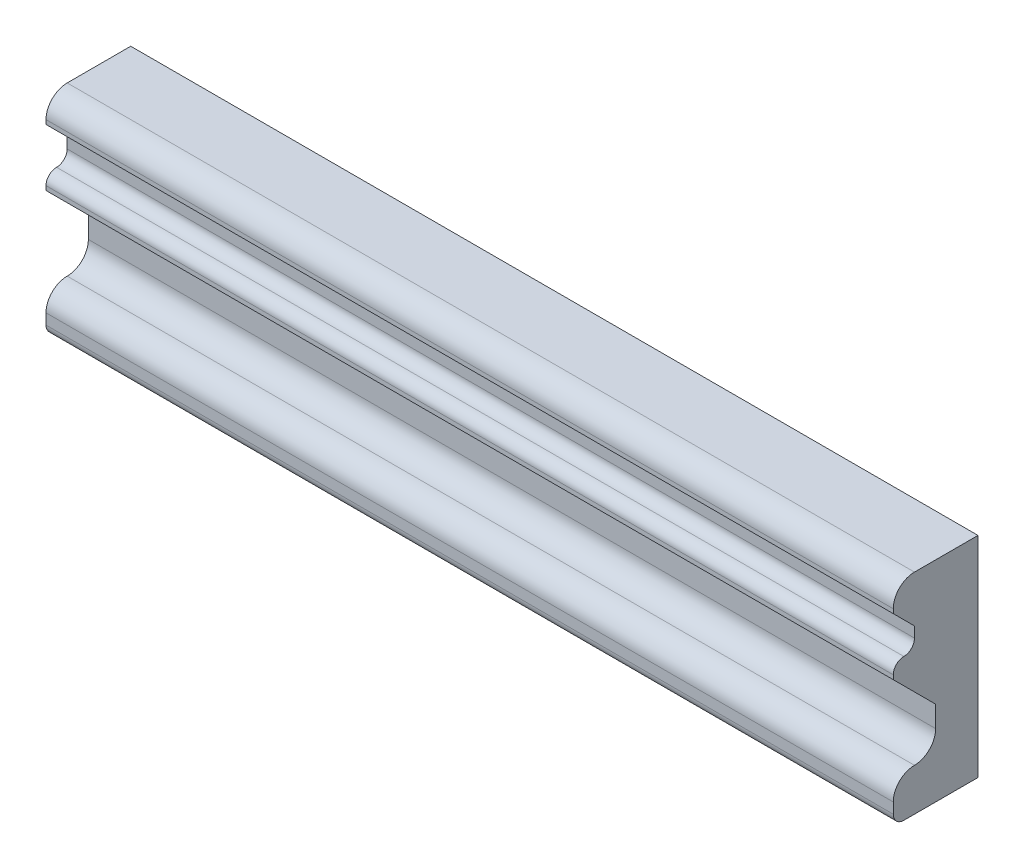
ISO-10303-21;
HEADER;
FILE_DESCRIPTION(('STEP AP214'),'2;1');
FILE_NAME('part.step','',(''),(''),'','','');
FILE_SCHEMA(('AUTOMOTIVE_DESIGN { 1 0 10303 214 1 1 1 1 }'));
ENDSEC;
DATA;
#1=APPLICATION_CONTEXT('core data for automotive mechanical design processes');
#2=APPLICATION_PROTOCOL_DEFINITION('international standard','automotive_design',2000,#1);
#3=PRODUCT_CONTEXT('',#1,'mechanical');
#4=PRODUCT('Part','Part','',(#3));
#5=PRODUCT_RELATED_PRODUCT_CATEGORY('part','',(#4));
#6=PRODUCT_DEFINITION_FORMATION('','',#4);
#7=PRODUCT_DEFINITION_CONTEXT('part definition',#1,'design');
#8=PRODUCT_DEFINITION('design','',#6,#7);
#9=PRODUCT_DEFINITION_SHAPE('','',#8);
#10=(LENGTH_UNIT() NAMED_UNIT(*) SI_UNIT(.MILLI.,.METRE.));
#11=(NAMED_UNIT(*) PLANE_ANGLE_UNIT() SI_UNIT($,.RADIAN.));
#12=(NAMED_UNIT(*) SI_UNIT($,.STERADIAN.) SOLID_ANGLE_UNIT());
#13=UNCERTAINTY_MEASURE_WITH_UNIT(LENGTH_MEASURE(1.E-05),#10,'distance_accuracy_value','');
#14=(GEOMETRIC_REPRESENTATION_CONTEXT(3) GLOBAL_UNCERTAINTY_ASSIGNED_CONTEXT((#13)) GLOBAL_UNIT_ASSIGNED_CONTEXT((#10,
#11,#12)) REPRESENTATION_CONTEXT('',''));
#15=CARTESIAN_POINT('',(0.,0.,0.));
#16=DIRECTION('',(0.,0.,1.));
#17=DIRECTION('',(1.,0.,0.));
#18=AXIS2_PLACEMENT_3D('',#15,#16,#17);
#19=CARTESIAN_POINT('',(400.,-49.5000000000001,-20.));
#20=DIRECTION('',(0.,0.,1.));
#21=DIRECTION('',(1.,0.,0.));
#22=AXIS2_PLACEMENT_3D('',#19,#20,#21);
#23=PLANE('',#22);
#24=DIRECTION('',(0.,1.,0.));
#25=VECTOR('',#24,1.);
#26=CARTESIAN_POINT('',(0.,-49.5000000000001,-20.));
#27=LINE('',#26,#25);
#28=CARTESIAN_POINT('',(0.,-49.5000000000001,-20.));
#29=VERTEX_POINT('',#28);
#30=CARTESIAN_POINT('',(0.,49.5000000000001,-20.));
#31=VERTEX_POINT('',#30);
#32=EDGE_CURVE('E176',#29,#31,#27,.T.);
#33=ORIENTED_EDGE('',*,*,#32,.T.);
#34=DIRECTION('',(-1.,0.,0.));
#35=VECTOR('',#34,1.);
#36=CARTESIAN_POINT('',(400.,49.5000000000001,-20.));
#37=LINE('',#36,#35);
#38=CARTESIAN_POINT('',(400.,49.5000000000001,-20.));
#39=VERTEX_POINT('',#38);
#40=EDGE_CURVE('E11',#39,#31,#37,.T.);
#41=ORIENTED_EDGE('',*,*,#40,.F.);
#42=DIRECTION('',(0.,1.,0.));
#43=VECTOR('',#42,1.);
#44=CARTESIAN_POINT('',(400.,-49.5000000000001,-20.));
#45=LINE('',#44,#43);
#46=CARTESIAN_POINT('',(400.,-49.5000000000001,-20.));
#47=VERTEX_POINT('',#46);
#48=EDGE_CURVE('E206',#47,#39,#45,.T.);
#49=ORIENTED_EDGE('',*,*,#48,.F.);
#50=DIRECTION('',(-1.,0.,0.));
#51=VECTOR('',#50,1.);
#52=CARTESIAN_POINT('',(400.,-49.5000000000001,-20.));
#53=LINE('',#52,#51);
#54=EDGE_CURVE('E172',#47,#29,#53,.T.);
#55=ORIENTED_EDGE('',*,*,#54,.T.);
#56=EDGE_LOOP('',(#33,#41,#49,#55));
#57=FACE_BOUND('',#56,.T.);
#58=ADVANCED_FACE('F32',(#57),#23,.F.);
#59=CARTESIAN_POINT('',(400.,49.5000000000001,-20.));
#60=DIRECTION('',(0.,-1.,0.));
#61=DIRECTION('',(0.,0.,-1.));
#62=AXIS2_PLACEMENT_3D('',#59,#60,#61);
#63=PLANE('',#62);
#64=DIRECTION('',(0.,0.,1.));
#65=VECTOR('',#64,1.);
#66=CARTESIAN_POINT('',(0.,49.5000000000001,-20.));
#67=LINE('',#66,#65);
#68=CARTESIAN_POINT('',(0.,49.5000000000001,10.));
#69=VERTEX_POINT('',#68);
#70=EDGE_CURVE('E179',#31,#69,#67,.T.);
#71=ORIENTED_EDGE('',*,*,#70,.T.);
#72=DIRECTION('',(-1.,0.,0.));
#73=VECTOR('',#72,1.);
#74=CARTESIAN_POINT('',(400.,49.5000000000001,10.));
#75=LINE('',#74,#73);
#76=CARTESIAN_POINT('',(400.,49.5000000000001,10.));
#77=VERTEX_POINT('',#76);
#78=EDGE_CURVE('E40',#77,#69,#75,.T.);
#79=ORIENTED_EDGE('',*,*,#78,.F.);
#80=DIRECTION('',(0.,0.,1.));
#81=VECTOR('',#80,1.);
#82=CARTESIAN_POINT('',(400.,49.5000000000001,-20.));
#83=LINE('',#82,#81);
#84=EDGE_CURVE('E115',#39,#77,#83,.T.);
#85=ORIENTED_EDGE('',*,*,#84,.F.);
#86=ORIENTED_EDGE('',*,*,#40,.T.);
#87=EDGE_LOOP('',(#71,#79,#85,#86));
#88=FACE_BOUND('',#87,.T.);
#89=ADVANCED_FACE('F304',(#88),#63,.F.);
#90=CARTESIAN_POINT('',(400.,39.5000000000001,10.));
#91=DIRECTION('',(-1.,0.,0.));
#92=DIRECTION('',(0.,0.,1.));
#93=AXIS2_PLACEMENT_3D('',#90,#91,#92);
#94=CYLINDRICAL_SURFACE('',#93,9.99999999999999);
#95=CARTESIAN_POINT('',(0.,39.5000000000001,10.));
#96=DIRECTION('',(1.,0.,0.));
#97=DIRECTION('',(0.,0.,-1.));
#98=AXIS2_PLACEMENT_3D('',#95,#96,#97);
#99=CIRCLE('',#98,9.99999999999999);
#100=CARTESIAN_POINT('',(0.,39.5000000000001,20.));
#101=VERTEX_POINT('',#100);
#102=EDGE_CURVE('E181',#69,#101,#99,.T.);
#103=ORIENTED_EDGE('',*,*,#102,.T.);
#104=DIRECTION('',(-1.,0.,0.));
#105=VECTOR('',#104,1.);
#106=CARTESIAN_POINT('',(400.,39.5000000000001,20.));
#107=LINE('',#106,#105);
#108=CARTESIAN_POINT('',(400.,39.5000000000001,20.));
#109=VERTEX_POINT('',#108);
#110=EDGE_CURVE('E237',#109,#101,#107,.T.);
#111=ORIENTED_EDGE('',*,*,#110,.F.);
#112=CARTESIAN_POINT('',(400.,39.5000000000001,10.));
#113=DIRECTION('',(1.,0.,0.));
#114=DIRECTION('',(0.,0.,-1.));
#115=AXIS2_PLACEMENT_3D('',#112,#113,#114);
#116=CIRCLE('',#115,9.99999999999999);
#117=EDGE_CURVE('E245',#77,#109,#116,.T.);
#118=ORIENTED_EDGE('',*,*,#117,.F.);
#119=ORIENTED_EDGE('',*,*,#78,.T.);
#120=EDGE_LOOP('',(#103,#111,#118,#119));
#121=FACE_BOUND('',#120,.T.);
#122=ADVANCED_FACE('F243',(#121),#94,.T.);
#123=CARTESIAN_POINT('',(400.,37.5000000000001,20.));
#124=DIRECTION('',(0.,0.,-1.));
#125=DIRECTION('',(0.,1.,0.));
#126=AXIS2_PLACEMENT_3D('',#123,#124,#125);
#127=PLANE('',#126);
#128=DIRECTION('',(0.,-1.,0.));
#129=VECTOR('',#128,1.);
#130=CARTESIAN_POINT('',(0.,37.5000000000001,20.));
#131=LINE('',#130,#129);
#132=CARTESIAN_POINT('',(0.,37.5000000000001,20.));
#133=VERTEX_POINT('',#132);
#134=EDGE_CURVE('E183',#101,#133,#131,.T.);
#135=ORIENTED_EDGE('',*,*,#134,.T.);
#136=DIRECTION('',(-1.,0.,0.));
#137=VECTOR('',#136,1.);
#138=CARTESIAN_POINT('',(400.,37.5000000000001,20.));
#139=LINE('',#138,#137);
#140=CARTESIAN_POINT('',(400.,37.5000000000001,20.));
#141=VERTEX_POINT('',#140);
#142=EDGE_CURVE('E234',#141,#133,#139,.T.);
#143=ORIENTED_EDGE('',*,*,#142,.F.);
#144=DIRECTION('',(0.,-1.,0.));
#145=VECTOR('',#144,1.);
#146=CARTESIAN_POINT('',(400.,37.5000000000001,20.));
#147=LINE('',#146,#145);
#148=EDGE_CURVE('E263',#109,#141,#147,.T.);
#149=ORIENTED_EDGE('',*,*,#148,.F.);
#150=ORIENTED_EDGE('',*,*,#110,.T.);
#151=EDGE_LOOP('',(#135,#143,#149,#150));
#152=FACE_BOUND('',#151,.T.);
#153=ADVANCED_FACE('F254',(#152),#127,.F.);
#154=CARTESIAN_POINT('',(400.,37.5000000000001,20.));
#155=DIRECTION('',(0.,0.707106781186544,-0.707106781186551));
#156=DIRECTION('',(0.,0.707106781186551,0.707106781186544));
#157=AXIS2_PLACEMENT_3D('',#154,#155,#156);
#158=PLANE('',#157);
#159=DIRECTION('',(0.,-0.707106781186551,-0.707106781186544));
#160=VECTOR('',#159,1.);
#161=CARTESIAN_POINT('',(0.,37.5000000000001,20.));
#162=LINE('',#161,#160);
#163=CARTESIAN_POINT('',(0.,27.5,10.));
#164=VERTEX_POINT('',#163);
#165=EDGE_CURVE('E185',#133,#164,#162,.T.);
#166=ORIENTED_EDGE('',*,*,#165,.T.);
#167=DIRECTION('',(-1.,0.,0.));
#168=VECTOR('',#167,1.);
#169=CARTESIAN_POINT('',(400.,27.5,10.));
#170=LINE('',#169,#168);
#171=CARTESIAN_POINT('',(400.,27.5,10.));
#172=VERTEX_POINT('',#171);
#173=EDGE_CURVE('E231',#172,#164,#170,.T.);
#174=ORIENTED_EDGE('',*,*,#173,.F.);
#175=DIRECTION('',(0.,-0.707106781186551,-0.707106781186544));
#176=VECTOR('',#175,1.);
#177=CARTESIAN_POINT('',(400.,37.5000000000001,20.));
#178=LINE('',#177,#176);
#179=EDGE_CURVE('E260',#141,#172,#178,.T.);
#180=ORIENTED_EDGE('',*,*,#179,.F.);
#181=ORIENTED_EDGE('',*,*,#142,.T.);
#182=EDGE_LOOP('',(#166,#174,#180,#181));
#183=FACE_BOUND('',#182,.T.);
#184=ADVANCED_FACE('F258',(#183),#158,.F.);
#185=CARTESIAN_POINT('',(400.,27.5,10.));
#186=DIRECTION('',(0.,0.,-1.));
#187=DIRECTION('',(0.,1.,0.));
#188=AXIS2_PLACEMENT_3D('',#185,#186,#187);
#189=PLANE('',#188);
#190=DIRECTION('',(0.,-1.,0.));
#191=VECTOR('',#190,1.);
#192=CARTESIAN_POINT('',(0.,27.5,10.));
#193=LINE('',#192,#191);
#194=CARTESIAN_POINT('',(0.,22.5000000000001,10.));
#195=VERTEX_POINT('',#194);
#196=EDGE_CURVE('E187',#164,#195,#193,.T.);
#197=ORIENTED_EDGE('',*,*,#196,.T.);
#198=DIRECTION('',(-1.,0.,0.));
#199=VECTOR('',#198,1.);
#200=CARTESIAN_POINT('',(400.,22.5000000000001,10.));
#201=LINE('',#200,#199);
#202=CARTESIAN_POINT('',(400.,22.5000000000001,10.));
#203=VERTEX_POINT('',#202);
#204=EDGE_CURVE('E228',#203,#195,#201,.T.);
#205=ORIENTED_EDGE('',*,*,#204,.F.);
#206=DIRECTION('',(0.,-1.,0.));
#207=VECTOR('',#206,1.);
#208=CARTESIAN_POINT('',(400.,27.5,10.));
#209=LINE('',#208,#207);
#210=EDGE_CURVE('E262',#172,#203,#209,.T.);
#211=ORIENTED_EDGE('',*,*,#210,.F.);
#212=ORIENTED_EDGE('',*,*,#173,.T.);
#213=EDGE_LOOP('',(#197,#205,#211,#212));
#214=FACE_BOUND('',#213,.T.);
#215=ADVANCED_FACE('F317',(#214),#189,.F.);
#216=CARTESIAN_POINT('',(400.,22.5000000000001,15.));
#217=DIRECTION('',(-1.,0.,0.));
#218=DIRECTION('',(0.,0.,1.));
#219=AXIS2_PLACEMENT_3D('',#216,#217,#218);
#220=CYLINDRICAL_SURFACE('',#219,5.);
#221=CARTESIAN_POINT('',(0.,22.5000000000001,15.));
#222=DIRECTION('',(-1.,0.,0.));
#223=DIRECTION('',(0.,0.,-1.));
#224=AXIS2_PLACEMENT_3D('',#221,#222,#223);
#225=CIRCLE('',#224,5.);
#226=CARTESIAN_POINT('',(0.,17.5000000000001,15.));
#227=VERTEX_POINT('',#226);
#228=EDGE_CURVE('E189',#195,#227,#225,.T.);
#229=ORIENTED_EDGE('',*,*,#228,.T.);
#230=DIRECTION('',(-1.,0.,0.));
#231=VECTOR('',#230,1.);
#232=CARTESIAN_POINT('',(400.,17.5000000000001,15.));
#233=LINE('',#232,#231);
#234=CARTESIAN_POINT('',(400.,17.5000000000001,15.));
#235=VERTEX_POINT('',#234);
#236=EDGE_CURVE('E225',#235,#227,#233,.T.);
#237=ORIENTED_EDGE('',*,*,#236,.F.);
#238=CARTESIAN_POINT('',(400.,22.5000000000001,15.));
#239=DIRECTION('',(-1.,0.,0.));
#240=DIRECTION('',(0.,0.,-1.));
#241=AXIS2_PLACEMENT_3D('',#238,#239,#240);
#242=CIRCLE('',#241,5.);
#243=EDGE_CURVE('E265',#203,#235,#242,.T.);
#244=ORIENTED_EDGE('',*,*,#243,.F.);
#245=ORIENTED_EDGE('',*,*,#204,.T.);
#246=EDGE_LOOP('',(#229,#237,#244,#245));
#247=FACE_BOUND('',#246,.T.);
#248=ADVANCED_FACE('F320',(#247),#220,.F.);
#249=CARTESIAN_POINT('',(400.,12.5000000000001,15.));
#250=DIRECTION('',(-1.,0.,0.));
#251=DIRECTION('',(0.,0.,1.));
#252=AXIS2_PLACEMENT_3D('',#249,#250,#251);
#253=CYLINDRICAL_SURFACE('',#252,5.);
#254=CARTESIAN_POINT('',(0.,12.5000000000001,15.));
#255=DIRECTION('',(1.,0.,0.));
#256=DIRECTION('',(0.,0.,-1.));
#257=AXIS2_PLACEMENT_3D('',#254,#255,#256);
#258=CIRCLE('',#257,5.);
#259=CARTESIAN_POINT('',(0.,12.5000000000001,20.));
#260=VERTEX_POINT('',#259);
#261=EDGE_CURVE('E191',#227,#260,#258,.T.);
#262=ORIENTED_EDGE('',*,*,#261,.T.);
#263=DIRECTION('',(-1.,0.,0.));
#264=VECTOR('',#263,1.);
#265=CARTESIAN_POINT('',(400.,12.5000000000001,20.));
#266=LINE('',#265,#264);
#267=CARTESIAN_POINT('',(400.,12.5000000000001,20.));
#268=VERTEX_POINT('',#267);
#269=EDGE_CURVE('E222',#268,#260,#266,.T.);
#270=ORIENTED_EDGE('',*,*,#269,.F.);
#271=CARTESIAN_POINT('',(400.,12.5000000000001,15.));
#272=DIRECTION('',(1.,0.,0.));
#273=DIRECTION('',(0.,0.,-1.));
#274=AXIS2_PLACEMENT_3D('',#271,#272,#273);
#275=CIRCLE('',#274,5.);
#276=EDGE_CURVE('E271',#235,#268,#275,.T.);
#277=ORIENTED_EDGE('',*,*,#276,.F.);
#278=ORIENTED_EDGE('',*,*,#236,.T.);
#279=EDGE_LOOP('',(#262,#270,#277,#278));
#280=FACE_BOUND('',#279,.T.);
#281=ADVANCED_FACE('F324',(#280),#253,.T.);
#282=CARTESIAN_POINT('',(400.,10.5000000000001,20.));
#283=DIRECTION('',(0.,0.,-1.));
#284=DIRECTION('',(0.,1.,0.));
#285=AXIS2_PLACEMENT_3D('',#282,#283,#284);
#286=PLANE('',#285);
#287=DIRECTION('',(0.,-1.,0.));
#288=VECTOR('',#287,1.);
#289=CARTESIAN_POINT('',(0.,10.5000000000001,20.));
#290=LINE('',#289,#288);
#291=CARTESIAN_POINT('',(0.,10.5000000000001,20.));
#292=VERTEX_POINT('',#291);
#293=EDGE_CURVE('E193',#260,#292,#290,.T.);
#294=ORIENTED_EDGE('',*,*,#293,.T.);
#295=DIRECTION('',(-1.,0.,0.));
#296=VECTOR('',#295,1.);
#297=CARTESIAN_POINT('',(400.,10.5000000000001,20.));
#298=LINE('',#297,#296);
#299=CARTESIAN_POINT('',(400.,10.5000000000001,20.));
#300=VERTEX_POINT('',#299);
#301=EDGE_CURVE('E219',#300,#292,#298,.T.);
#302=ORIENTED_EDGE('',*,*,#301,.F.);
#303=DIRECTION('',(0.,-1.,0.));
#304=VECTOR('',#303,1.);
#305=CARTESIAN_POINT('',(400.,10.5000000000001,20.));
#306=LINE('',#305,#304);
#307=EDGE_CURVE('E273',#268,#300,#306,.T.);
#308=ORIENTED_EDGE('',*,*,#307,.F.);
#309=ORIENTED_EDGE('',*,*,#269,.T.);
#310=EDGE_LOOP('',(#294,#302,#308,#309));
#311=FACE_BOUND('',#310,.T.);
#312=ADVANCED_FACE('F328',(#311),#286,.F.);
#313=CARTESIAN_POINT('',(400.,10.5000000000001,20.));
#314=DIRECTION('',(0.,0.707106781186544,-0.707106781186551));
#315=DIRECTION('',(0.,0.707106781186551,0.707106781186544));
#316=AXIS2_PLACEMENT_3D('',#313,#314,#315);
#317=PLANE('',#316);
#318=DIRECTION('',(0.,-0.707106781186551,-0.707106781186544));
#319=VECTOR('',#318,1.);
#320=CARTESIAN_POINT('',(0.,10.5000000000001,20.));
#321=LINE('',#320,#319);
#322=CARTESIAN_POINT('',(0.,-9.50000000000009,0.));
#323=VERTEX_POINT('',#322);
#324=EDGE_CURVE('E195',#292,#323,#321,.T.);
#325=ORIENTED_EDGE('',*,*,#324,.T.);
#326=DIRECTION('',(-1.,0.,0.));
#327=VECTOR('',#326,1.);
#328=CARTESIAN_POINT('',(400.,-9.50000000000009,0.));
#329=LINE('',#328,#327);
#330=CARTESIAN_POINT('',(400.,-9.50000000000009,0.));
#331=VERTEX_POINT('',#330);
#332=EDGE_CURVE('E216',#331,#323,#329,.T.);
#333=ORIENTED_EDGE('',*,*,#332,.F.);
#334=DIRECTION('',(0.,-0.707106781186551,-0.707106781186544));
#335=VECTOR('',#334,1.);
#336=CARTESIAN_POINT('',(400.,10.5000000000001,20.));
#337=LINE('',#336,#335);
#338=EDGE_CURVE('E275',#300,#331,#337,.T.);
#339=ORIENTED_EDGE('',*,*,#338,.F.);
#340=ORIENTED_EDGE('',*,*,#301,.T.);
#341=EDGE_LOOP('',(#325,#333,#339,#340));
#342=FACE_BOUND('',#341,.T.);
#343=ADVANCED_FACE('F332',(#342),#317,.F.);
#344=CARTESIAN_POINT('',(400.,-19.5000000000001,0.));
#345=DIRECTION('',(0.,0.,-1.));
#346=DIRECTION('',(-1.,0.,0.));
#347=AXIS2_PLACEMENT_3D('',#344,#345,#346);
#348=PLANE('',#347);
#349=DIRECTION('',(0.,-1.,0.));
#350=VECTOR('',#349,1.);
#351=CARTESIAN_POINT('',(0.,-19.5000000000001,0.));
#352=LINE('',#351,#350);
#353=CARTESIAN_POINT('',(0.,-19.5000000000001,0.));
#354=VERTEX_POINT('',#353);
#355=EDGE_CURVE('E197',#323,#354,#352,.T.);
#356=ORIENTED_EDGE('',*,*,#355,.T.);
#357=DIRECTION('',(-1.,0.,0.));
#358=VECTOR('',#357,1.);
#359=CARTESIAN_POINT('',(400.,-19.5000000000001,0.));
#360=LINE('',#359,#358);
#361=CARTESIAN_POINT('',(400.,-19.5000000000001,0.));
#362=VERTEX_POINT('',#361);
#363=EDGE_CURVE('E213',#362,#354,#360,.T.);
#364=ORIENTED_EDGE('',*,*,#363,.F.);
#365=DIRECTION('',(0.,-1.,0.));
#366=VECTOR('',#365,1.);
#367=CARTESIAN_POINT('',(400.,-19.5000000000001,0.));
#368=LINE('',#367,#366);
#369=EDGE_CURVE('E277',#331,#362,#368,.T.);
#370=ORIENTED_EDGE('',*,*,#369,.F.);
#371=ORIENTED_EDGE('',*,*,#332,.T.);
#372=EDGE_LOOP('',(#356,#364,#370,#371));
#373=FACE_BOUND('',#372,.T.);
#374=ADVANCED_FACE('F336',(#373),#348,.F.);
#375=CARTESIAN_POINT('',(400.,-19.5000000000001,10.));
#376=DIRECTION('',(-1.,0.,0.));
#377=DIRECTION('',(0.,0.,1.));
#378=AXIS2_PLACEMENT_3D('',#375,#376,#377);
#379=CYLINDRICAL_SURFACE('',#378,10.);
#380=CARTESIAN_POINT('',(0.,-19.5000000000001,10.));
#381=DIRECTION('',(-1.,0.,0.));
#382=DIRECTION('',(0.,0.,-1.));
#383=AXIS2_PLACEMENT_3D('',#380,#381,#382);
#384=CIRCLE('',#383,10.);
#385=CARTESIAN_POINT('',(0.,-29.5000000000001,10.));
#386=VERTEX_POINT('',#385);
#387=EDGE_CURVE('E199',#354,#386,#384,.T.);
#388=ORIENTED_EDGE('',*,*,#387,.T.);
#389=DIRECTION('',(-1.,0.,0.));
#390=VECTOR('',#389,1.);
#391=CARTESIAN_POINT('',(400.,-29.5000000000001,10.));
#392=LINE('',#391,#390);
#393=CARTESIAN_POINT('',(400.,-29.5000000000001,10.));
#394=VERTEX_POINT('',#393);
#395=EDGE_CURVE('E210',#394,#386,#392,.T.);
#396=ORIENTED_EDGE('',*,*,#395,.F.);
#397=CARTESIAN_POINT('',(400.,-19.5000000000001,10.));
#398=DIRECTION('',(-1.,0.,0.));
#399=DIRECTION('',(0.,0.,-1.));
#400=AXIS2_PLACEMENT_3D('',#397,#398,#399);
#401=CIRCLE('',#400,10.);
#402=EDGE_CURVE('E279',#362,#394,#401,.T.);
#403=ORIENTED_EDGE('',*,*,#402,.F.);
#404=ORIENTED_EDGE('',*,*,#363,.T.);
#405=EDGE_LOOP('',(#388,#396,#403,#404));
#406=FACE_BOUND('',#405,.T.);
#407=ADVANCED_FACE('F285',(#406),#379,.F.);
#408=CARTESIAN_POINT('',(400.,-39.5000000000001,10.));
#409=DIRECTION('',(-1.,0.,0.));
#410=DIRECTION('',(0.,0.,1.));
#411=AXIS2_PLACEMENT_3D('',#408,#409,#410);
#412=CYLINDRICAL_SURFACE('',#411,10.);
#413=CARTESIAN_POINT('',(0.,-39.5000000000001,10.));
#414=DIRECTION('',(1.,0.,0.));
#415=DIRECTION('',(0.,0.,-1.));
#416=AXIS2_PLACEMENT_3D('',#413,#414,#415);
#417=CIRCLE('',#416,10.);
#418=CARTESIAN_POINT('',(0.,-39.5000000000001,20.));
#419=VERTEX_POINT('',#418);
#420=EDGE_CURVE('E201',#386,#419,#417,.T.);
#421=ORIENTED_EDGE('',*,*,#420,.T.);
#422=DIRECTION('',(-1.,0.,0.));
#423=VECTOR('',#422,1.);
#424=CARTESIAN_POINT('',(400.,-39.5000000000001,20.));
#425=LINE('',#424,#423);
#426=CARTESIAN_POINT('',(400.,-39.5000000000001,20.));
#427=VERTEX_POINT('',#426);
#428=EDGE_CURVE('E167',#427,#419,#425,.T.);
#429=ORIENTED_EDGE('',*,*,#428,.F.);
#430=CARTESIAN_POINT('',(400.,-39.5000000000001,10.));
#431=DIRECTION('',(1.,0.,0.));
#432=DIRECTION('',(0.,0.,-1.));
#433=AXIS2_PLACEMENT_3D('',#430,#431,#432);
#434=CIRCLE('',#433,10.);
#435=EDGE_CURVE('E158',#394,#427,#434,.T.);
#436=ORIENTED_EDGE('',*,*,#435,.F.);
#437=ORIENTED_EDGE('',*,*,#395,.T.);
#438=EDGE_LOOP('',(#421,#429,#436,#437));
#439=FACE_BOUND('',#438,.T.);
#440=ADVANCED_FACE('F289',(#439),#412,.T.);
#441=CARTESIAN_POINT('',(400.,-44.5000000000001,20.));
#442=DIRECTION('',(0.,0.,-1.));
#443=DIRECTION('',(-1.,0.,0.));
#444=AXIS2_PLACEMENT_3D('',#441,#442,#443);
#445=PLANE('',#444);
#446=DIRECTION('',(0.,-1.,0.));
#447=VECTOR('',#446,1.);
#448=CARTESIAN_POINT('',(0.,-44.5000000000001,20.));
#449=LINE('',#448,#447);
#450=CARTESIAN_POINT('',(0.,-44.5000000000001,20.));
#451=VERTEX_POINT('',#450);
#452=EDGE_CURVE('E166',#419,#451,#449,.T.);
#453=ORIENTED_EDGE('',*,*,#452,.T.);
#454=DIRECTION('',(-1.,0.,0.));
#455=VECTOR('',#454,1.);
#456=CARTESIAN_POINT('',(400.,-44.5000000000001,20.));
#457=LINE('',#456,#455);
#458=CARTESIAN_POINT('',(400.,-44.5000000000001,20.));
#459=VERTEX_POINT('',#458);
#460=EDGE_CURVE('E163',#459,#451,#457,.T.);
#461=ORIENTED_EDGE('',*,*,#460,.F.);
#462=DIRECTION('',(0.,-1.,0.));
#463=VECTOR('',#462,1.);
#464=CARTESIAN_POINT('',(400.,-44.5000000000001,20.));
#465=LINE('',#464,#463);
#466=EDGE_CURVE('E152',#427,#459,#465,.T.);
#467=ORIENTED_EDGE('',*,*,#466,.F.);
#468=ORIENTED_EDGE('',*,*,#428,.T.);
#469=EDGE_LOOP('',(#453,#461,#467,#468));
#470=FACE_BOUND('',#469,.T.);
#471=ADVANCED_FACE('F164',(#470),#445,.F.);
#472=CARTESIAN_POINT('',(400.,-44.5000000000001,15.));
#473=DIRECTION('',(-1.,0.,0.));
#474=DIRECTION('',(0.,0.,1.));
#475=AXIS2_PLACEMENT_3D('',#472,#473,#474);
#476=CYLINDRICAL_SURFACE('',#475,5.);
#477=CARTESIAN_POINT('',(0.,-44.5000000000001,15.));
#478=DIRECTION('',(1.,0.,0.));
#479=DIRECTION('',(0.,0.,1.));
#480=AXIS2_PLACEMENT_3D('',#477,#478,#479);
#481=CIRCLE('',#480,5.);
#482=CARTESIAN_POINT('',(0.,-49.5000000000001,15.));
#483=VERTEX_POINT('',#482);
#484=EDGE_CURVE('E101',#451,#483,#481,.T.);
#485=ORIENTED_EDGE('',*,*,#484,.T.);
#486=DIRECTION('',(-1.,0.,0.));
#487=VECTOR('',#486,1.);
#488=CARTESIAN_POINT('',(400.,-49.5000000000001,15.));
#489=LINE('',#488,#487);
#490=CARTESIAN_POINT('',(400.,-49.5000000000001,15.));
#491=VERTEX_POINT('',#490);
#492=EDGE_CURVE('E168',#491,#483,#489,.T.);
#493=ORIENTED_EDGE('',*,*,#492,.F.);
#494=CARTESIAN_POINT('',(400.,-44.5000000000001,15.));
#495=DIRECTION('',(1.,0.,0.));
#496=DIRECTION('',(0.,0.,1.));
#497=AXIS2_PLACEMENT_3D('',#494,#495,#496);
#498=CIRCLE('',#497,5.);
#499=EDGE_CURVE('E156',#459,#491,#498,.T.);
#500=ORIENTED_EDGE('',*,*,#499,.F.);
#501=ORIENTED_EDGE('',*,*,#460,.T.);
#502=EDGE_LOOP('',(#485,#493,#500,#501));
#503=FACE_BOUND('',#502,.T.);
#504=ADVANCED_FACE('F170',(#503),#476,.T.);
#505=CARTESIAN_POINT('',(400.,-49.5000000000001,-20.));
#506=DIRECTION('',(0.,1.,0.));
#507=DIRECTION('',(0.,0.,1.));
#508=AXIS2_PLACEMENT_3D('',#505,#506,#507);
#509=PLANE('',#508);
#510=DIRECTION('',(0.,0.,-1.));
#511=VECTOR('',#510,1.);
#512=CARTESIAN_POINT('',(0.,-49.5000000000001,-20.));
#513=LINE('',#512,#511);
#514=EDGE_CURVE('E107',#483,#29,#513,.T.);
#515=ORIENTED_EDGE('',*,*,#514,.T.);
#516=ORIENTED_EDGE('',*,*,#54,.F.);
#517=DIRECTION('',(0.,0.,-1.));
#518=VECTOR('',#517,1.);
#519=CARTESIAN_POINT('',(400.,-49.5000000000001,-20.));
#520=LINE('',#519,#518);
#521=EDGE_CURVE('E48',#491,#47,#520,.T.);
#522=ORIENTED_EDGE('',*,*,#521,.F.);
#523=ORIENTED_EDGE('',*,*,#492,.T.);
#524=EDGE_LOOP('',(#515,#516,#522,#523));
#525=FACE_BOUND('',#524,.T.);
#526=ADVANCED_FACE('F293',(#525),#509,.F.);
#527=CARTESIAN_POINT('',(400.,39.5000000000001,10.));
#528=DIRECTION('',(1.,0.,0.));
#529=DIRECTION('',(0.,0.,-1.));
#530=AXIS2_PLACEMENT_3D('',#527,#528,#529);
#531=PLANE('',#530);
#532=ORIENTED_EDGE('',*,*,#48,.T.);
#533=ORIENTED_EDGE('',*,*,#84,.T.);
#534=ORIENTED_EDGE('',*,*,#117,.T.);
#535=ORIENTED_EDGE('',*,*,#148,.T.);
#536=ORIENTED_EDGE('',*,*,#179,.T.);
#537=ORIENTED_EDGE('',*,*,#210,.T.);
#538=ORIENTED_EDGE('',*,*,#243,.T.);
#539=ORIENTED_EDGE('',*,*,#276,.T.);
#540=ORIENTED_EDGE('',*,*,#307,.T.);
#541=ORIENTED_EDGE('',*,*,#338,.T.);
#542=ORIENTED_EDGE('',*,*,#369,.T.);
#543=ORIENTED_EDGE('',*,*,#402,.T.);
#544=ORIENTED_EDGE('',*,*,#435,.T.);
#545=ORIENTED_EDGE('',*,*,#466,.T.);
#546=ORIENTED_EDGE('',*,*,#499,.T.);
#547=ORIENTED_EDGE('',*,*,#521,.T.);
#548=EDGE_LOOP('',(#532,#533,#534,#535,#536,#537,#538,#539,#540,#541,#542,#543,#544,#545,#546,#547));
#549=FACE_BOUND('',#548,.T.);
#550=ADVANCED_FACE('F154',(#549),#531,.T.);
#551=CARTESIAN_POINT('',(0.,39.5000000000001,10.));
#552=DIRECTION('',(1.,0.,0.));
#553=DIRECTION('',(0.,0.,-1.));
#554=AXIS2_PLACEMENT_3D('',#551,#552,#553);
#555=PLANE('',#554);
#556=ORIENTED_EDGE('',*,*,#32,.F.);
#557=ORIENTED_EDGE('',*,*,#514,.F.);
#558=ORIENTED_EDGE('',*,*,#484,.F.);
#559=ORIENTED_EDGE('',*,*,#452,.F.);
#560=ORIENTED_EDGE('',*,*,#420,.F.);
#561=ORIENTED_EDGE('',*,*,#387,.F.);
#562=ORIENTED_EDGE('',*,*,#355,.F.);
#563=ORIENTED_EDGE('',*,*,#324,.F.);
#564=ORIENTED_EDGE('',*,*,#293,.F.);
#565=ORIENTED_EDGE('',*,*,#261,.F.);
#566=ORIENTED_EDGE('',*,*,#228,.F.);
#567=ORIENTED_EDGE('',*,*,#196,.F.);
#568=ORIENTED_EDGE('',*,*,#165,.F.);
#569=ORIENTED_EDGE('',*,*,#134,.F.);
#570=ORIENTED_EDGE('',*,*,#102,.F.);
#571=ORIENTED_EDGE('',*,*,#70,.F.);
#572=EDGE_LOOP('',(#556,#557,#558,#559,#560,#561,#562,#563,#564,#565,#566,#567,#568,#569,#570,#571));
#573=FACE_BOUND('',#572,.T.);
#574=ADVANCED_FACE('F249',(#573),#555,.F.);
#575=CLOSED_SHELL('',(#58,#89,#122,#153,#184,#215,#248,#281,#312,#343,#374,#407,#440,#471,#504,
#526,#550,#574));
#576=MANIFOLD_SOLID_BREP('B2',#575);
#577=ADVANCED_BREP_SHAPE_REPRESENTATION('',(#18,#576),#14);
#578=SHAPE_DEFINITION_REPRESENTATION(#9,#577);
ENDSEC;
END-ISO-10303-21;
